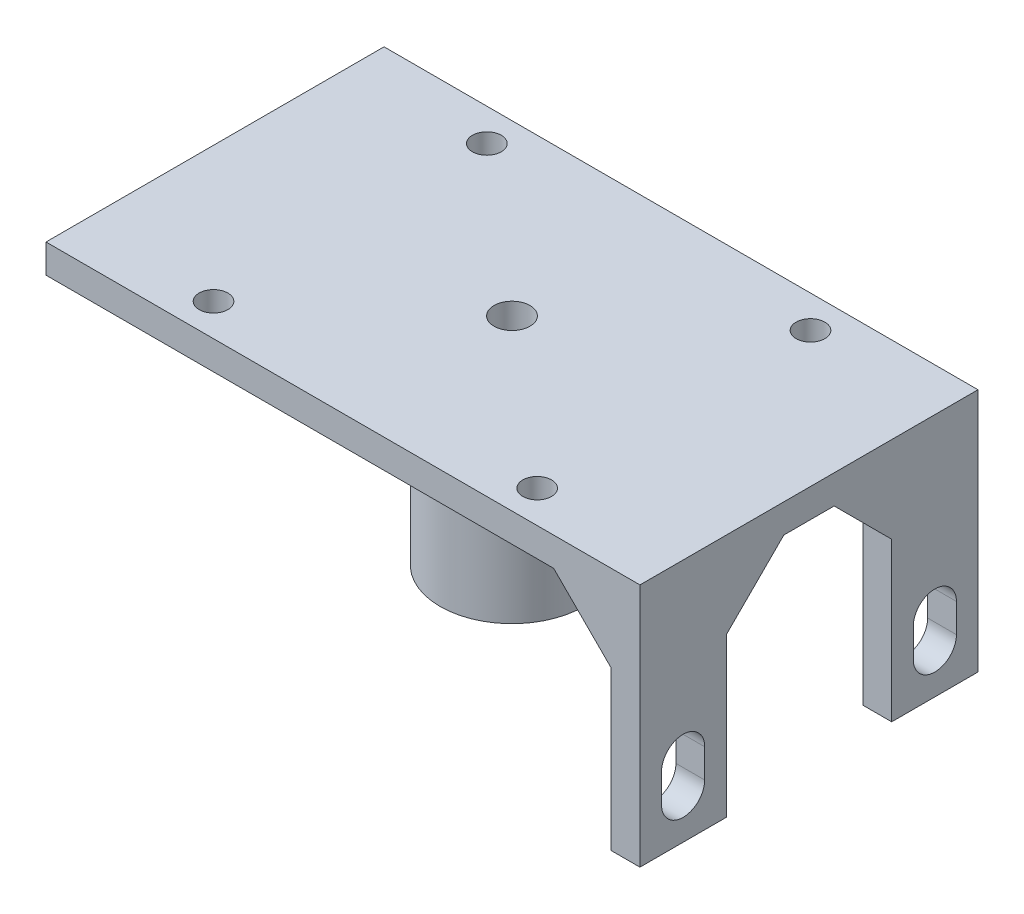
ISO-10303-21;
HEADER;
FILE_DESCRIPTION(('STEP AP214'),'2;1');
FILE_NAME('part.step','',(''),(''),'','','');
FILE_SCHEMA(('AUTOMOTIVE_DESIGN { 1 0 10303 214 1 1 1 1 }'));
ENDSEC;
DATA;
#1=APPLICATION_CONTEXT('core data for automotive mechanical design processes');
#2=APPLICATION_PROTOCOL_DEFINITION('international standard','automotive_design',2000,#1);
#3=PRODUCT_CONTEXT('',#1,'mechanical');
#4=PRODUCT('Part','Part','',(#3));
#5=PRODUCT_RELATED_PRODUCT_CATEGORY('part','',(#4));
#6=PRODUCT_DEFINITION_FORMATION('','',#4);
#7=PRODUCT_DEFINITION_CONTEXT('part definition',#1,'design');
#8=PRODUCT_DEFINITION('design','',#6,#7);
#9=PRODUCT_DEFINITION_SHAPE('','',#8);
#10=(LENGTH_UNIT() NAMED_UNIT(*) SI_UNIT(.MILLI.,.METRE.));
#11=(NAMED_UNIT(*) PLANE_ANGLE_UNIT() SI_UNIT($,.RADIAN.));
#12=(NAMED_UNIT(*) SI_UNIT($,.STERADIAN.) SOLID_ANGLE_UNIT());
#13=UNCERTAINTY_MEASURE_WITH_UNIT(LENGTH_MEASURE(1.E-05),#10,'distance_accuracy_value','');
#14=(GEOMETRIC_REPRESENTATION_CONTEXT(3) GLOBAL_UNCERTAINTY_ASSIGNED_CONTEXT((#13)) GLOBAL_UNIT_ASSIGNED_CONTEXT((#10,
#11,#12)) REPRESENTATION_CONTEXT('',''));
#15=CARTESIAN_POINT('',(0.,0.,0.));
#16=DIRECTION('',(0.,0.,1.));
#17=DIRECTION('',(1.,0.,0.));
#18=AXIS2_PLACEMENT_3D('',#15,#16,#17);
#19=CARTESIAN_POINT('',(0.,-0.0001,0.));
#20=DIRECTION('',(0.,1.,0.));
#21=DIRECTION('',(0.,0.,1.));
#22=AXIS2_PLACEMENT_3D('',#19,#20,#21);
#23=PLANE('',#22);
#24=CARTESIAN_POINT('',(-22.5,-0.000100000000000273,-19.));
#25=DIRECTION('',(0.,1.,0.));
#26=DIRECTION('',(0.,0.,1.));
#27=AXIS2_PLACEMENT_3D('',#24,#25,#26);
#28=CIRCLE('',#27,2.00000000000001);
#29=CARTESIAN_POINT('',(-22.5,-0.000100000000000273,-17.));
#30=VERTEX_POINT('',#29);
#31=EDGE_CURVE('E356',#30,#30,#28,.T.);
#32=ORIENTED_EDGE('',*,*,#31,.T.);
#33=EDGE_LOOP('',(#32));
#34=FACE_BOUND('',#33,.T.);
#35=CARTESIAN_POINT('',(22.5,-0.000100000000000273,-19.));
#36=DIRECTION('',(0.,1.,0.));
#37=DIRECTION('',(0.,0.,1.));
#38=AXIS2_PLACEMENT_3D('',#35,#36,#37);
#39=CIRCLE('',#38,2.);
#40=CARTESIAN_POINT('',(22.5,-0.000100000000000273,-17.));
#41=VERTEX_POINT('',#40);
#42=EDGE_CURVE('E363',#41,#41,#39,.T.);
#43=ORIENTED_EDGE('',*,*,#42,.T.);
#44=EDGE_LOOP('',(#43));
#45=FACE_BOUND('',#44,.T.);
#46=CARTESIAN_POINT('',(22.5,-0.000100000000000273,19.));
#47=DIRECTION('',(0.,1.,0.));
#48=DIRECTION('',(0.,0.,1.));
#49=AXIS2_PLACEMENT_3D('',#46,#47,#48);
#50=CIRCLE('',#49,2.);
#51=CARTESIAN_POINT('',(22.5,-0.000100000000000273,21.));
#52=VERTEX_POINT('',#51);
#53=EDGE_CURVE('E368',#52,#52,#50,.T.);
#54=ORIENTED_EDGE('',*,*,#53,.T.);
#55=EDGE_LOOP('',(#54));
#56=FACE_BOUND('',#55,.T.);
#57=CARTESIAN_POINT('',(-22.5,-0.000100000000000273,19.));
#58=DIRECTION('',(0.,1.,0.));
#59=DIRECTION('',(0.,0.,1.));
#60=AXIS2_PLACEMENT_3D('',#57,#58,#59);
#61=CIRCLE('',#60,2.);
#62=CARTESIAN_POINT('',(-22.5,-0.000100000000000273,21.));
#63=VERTEX_POINT('',#62);
#64=EDGE_CURVE('E526',#63,#63,#61,.T.);
#65=ORIENTED_EDGE('',*,*,#64,.T.);
#66=EDGE_LOOP('',(#65));
#67=FACE_BOUND('',#66,.T.);
#68=CARTESIAN_POINT('',(0.,-0.0001,0.));
#69=DIRECTION('',(0.,1.,0.));
#70=DIRECTION('',(0.,0.,1.));
#71=AXIS2_PLACEMENT_3D('',#68,#69,#70);
#72=CIRCLE('',#71,18.);
#73=CARTESIAN_POINT('',(0.,-0.0001,18.));
#74=VERTEX_POINT('',#73);
#75=EDGE_CURVE('E326',#74,#74,#72,.T.);
#76=ORIENTED_EDGE('',*,*,#75,.T.);
#77=EDGE_LOOP('',(#76));
#78=FACE_BOUND('',#77,.T.);
#79=DIRECTION('',(0.,0.,1.));
#80=VECTOR('',#79,1.);
#81=CARTESIAN_POINT('',(29.2905300612166,-0.0001,0.));
#82=LINE('',#81,#80);
#83=CARTESIAN_POINT('',(29.2905300612166,-0.0001,-23.5));
#84=VERTEX_POINT('',#83);
#85=CARTESIAN_POINT('',(29.2905300612166,-0.0001,-3.49999999999993));
#86=VERTEX_POINT('',#85);
#87=EDGE_CURVE('E329',#84,#86,#82,.T.);
#88=ORIENTED_EDGE('',*,*,#87,.T.);
#89=DIRECTION('',(1.,0.,0.));
#90=VECTOR('',#89,1.);
#91=CARTESIAN_POINT('',(0.,-0.0001,-3.49999999999993));
#92=LINE('',#91,#90);
#93=CARTESIAN_POINT('',(41.2905300612167,-0.0001,-3.49999999999993));
#94=VERTEX_POINT('',#93);
#95=EDGE_CURVE('E331',#86,#94,#92,.T.);
#96=ORIENTED_EDGE('',*,*,#95,.T.);
#97=DIRECTION('',(0.,0.,-1.));
#98=VECTOR('',#97,1.);
#99=CARTESIAN_POINT('',(41.2905300612167,-0.0001,23.5));
#100=LINE('',#99,#98);
#101=CARTESIAN_POINT('',(41.2905300612167,-0.0001,3.50000000000002));
#102=VERTEX_POINT('',#101);
#103=EDGE_CURVE('E255',#102,#94,#100,.T.);
#104=ORIENTED_EDGE('',*,*,#103,.F.);
#105=DIRECTION('',(-1.,0.,0.));
#106=VECTOR('',#105,1.);
#107=CARTESIAN_POINT('',(37.2905300612167,-0.0001,3.50000000000002));
#108=LINE('',#107,#106);
#109=CARTESIAN_POINT('',(29.2905300612167,-0.0001,3.50000000000002));
#110=VERTEX_POINT('',#109);
#111=EDGE_CURVE('E323',#102,#110,#108,.T.);
#112=ORIENTED_EDGE('',*,*,#111,.T.);
#113=DIRECTION('',(0.,0.,1.));
#114=VECTOR('',#113,1.);
#115=CARTESIAN_POINT('',(29.2905300612167,-0.0001,0.));
#116=LINE('',#115,#114);
#117=CARTESIAN_POINT('',(29.2905300612167,-0.0001,23.5));
#118=VERTEX_POINT('',#117);
#119=EDGE_CURVE('E315',#110,#118,#116,.T.);
#120=ORIENTED_EDGE('',*,*,#119,.T.);
#121=DIRECTION('',(1.,0.,0.));
#122=VECTOR('',#121,1.);
#123=CARTESIAN_POINT('',(41.2905300612167,-0.0001,23.5));
#124=LINE('',#123,#122);
#125=CARTESIAN_POINT('',(-41.2905300612167,-0.0001,23.5));
#126=VERTEX_POINT('',#125);
#127=EDGE_CURVE('E263',#126,#118,#124,.T.);
#128=ORIENTED_EDGE('',*,*,#127,.F.);
#129=DIRECTION('',(0.,0.,1.));
#130=VECTOR('',#129,1.);
#131=CARTESIAN_POINT('',(-41.2905300612167,-0.0001,23.5));
#132=LINE('',#131,#130);
#133=CARTESIAN_POINT('',(-41.2905300612167,-0.0001,-23.5));
#134=VERTEX_POINT('',#133);
#135=EDGE_CURVE('E260',#134,#126,#132,.T.);
#136=ORIENTED_EDGE('',*,*,#135,.F.);
#137=DIRECTION('',(-1.,0.,0.));
#138=VECTOR('',#137,1.);
#139=CARTESIAN_POINT('',(41.2905300612167,-0.0001,-23.5));
#140=LINE('',#139,#138);
#141=EDGE_CURVE('E258',#84,#134,#140,.T.);
#142=ORIENTED_EDGE('',*,*,#141,.F.);
#143=EDGE_LOOP('',(#88,#96,#104,#112,#120,#128,#136,#142));
#144=FACE_BOUND('',#143,.T.);
#145=ADVANCED_FACE('F34',(#34,#45,#56,#67,#78,#144),#23,.F.);
#146=CARTESIAN_POINT('',(37.2905300612167,0.,11.5));
#147=DIRECTION('',(0.,0.,1.));
#148=DIRECTION('',(0.,-1.,0.));
#149=AXIS2_PLACEMENT_3D('',#146,#147,#148);
#150=PLANE('',#149);
#151=DIRECTION('',(0.,-1.,0.));
#152=VECTOR('',#151,1.);
#153=CARTESIAN_POINT('',(37.2905300612167,0.,11.5));
#154=LINE('',#153,#152);
#155=CARTESIAN_POINT('',(37.2905300612167,-8.00010000000005,11.5));
#156=VERTEX_POINT('',#155);
#157=CARTESIAN_POINT('',(37.2905300612167,-29.99,11.5));
#158=VERTEX_POINT('',#157);
#159=EDGE_CURVE('E285',#156,#158,#154,.T.);
#160=ORIENTED_EDGE('',*,*,#159,.F.);
#161=DIRECTION('',(1.,0.,0.));
#162=VECTOR('',#161,1.);
#163=CARTESIAN_POINT('',(41.2905300612167,-8.00010000000004,11.5));
#164=LINE('',#163,#162);
#165=CARTESIAN_POINT('',(41.2905300612167,-8.00010000000004,11.5));
#166=VERTEX_POINT('',#165);
#167=EDGE_CURVE('E340',#156,#166,#164,.T.);
#168=ORIENTED_EDGE('',*,*,#167,.T.);
#169=DIRECTION('',(0.,-1.,0.));
#170=VECTOR('',#169,1.);
#171=CARTESIAN_POINT('',(41.2905300612167,0.,11.5));
#172=LINE('',#171,#170);
#173=CARTESIAN_POINT('',(41.2905300612167,-29.99,11.5));
#174=VERTEX_POINT('',#173);
#175=EDGE_CURVE('E304',#166,#174,#172,.T.);
#176=ORIENTED_EDGE('',*,*,#175,.T.);
#177=DIRECTION('',(1.,0.,0.));
#178=VECTOR('',#177,1.);
#179=CARTESIAN_POINT('',(37.2905300612167,-29.99,11.5));
#180=LINE('',#179,#178);
#181=EDGE_CURVE('E311',#158,#174,#180,.T.);
#182=ORIENTED_EDGE('',*,*,#181,.F.);
#183=EDGE_LOOP('',(#160,#168,#176,#182));
#184=FACE_BOUND('',#183,.T.);
#185=ADVANCED_FACE('F412',(#184),#150,.F.);
#186=CARTESIAN_POINT('',(37.2905300612167,0.,0.));
#187=DIRECTION('',(-1.,0.,0.));
#188=DIRECTION('',(0.,0.,1.));
#189=AXIS2_PLACEMENT_3D('',#186,#187,#188);
#190=PLANE('',#189);
#191=CARTESIAN_POINT('',(37.2905300612167,-23.99,17.5));
#192=DIRECTION('',(-1.,0.,0.));
#193=DIRECTION('',(0.,0.,1.));
#194=AXIS2_PLACEMENT_3D('',#191,#192,#193);
#195=CIRCLE('',#194,3.);
#196=CARTESIAN_POINT('',(37.2905300612167,-23.99,14.5));
#197=VERTEX_POINT('',#196);
#198=CARTESIAN_POINT('',(37.2905300612167,-23.99,20.5));
#199=VERTEX_POINT('',#198);
#200=EDGE_CURVE('E271',#197,#199,#195,.T.);
#201=ORIENTED_EDGE('',*,*,#200,.F.);
#202=DIRECTION('',(0.,-1.,0.));
#203=VECTOR('',#202,1.);
#204=CARTESIAN_POINT('',(37.2905300612167,0.,14.5));
#205=LINE('',#204,#203);
#206=CARTESIAN_POINT('',(37.2905300612167,-19.99,14.5));
#207=VERTEX_POINT('',#206);
#208=EDGE_CURVE('E274',#207,#197,#205,.T.);
#209=ORIENTED_EDGE('',*,*,#208,.F.);
#210=CARTESIAN_POINT('',(37.2905300612167,-19.99,17.5));
#211=DIRECTION('',(-1.,0.,0.));
#212=DIRECTION('',(0.,0.,1.));
#213=AXIS2_PLACEMENT_3D('',#210,#211,#212);
#214=CIRCLE('',#213,3.);
#215=CARTESIAN_POINT('',(37.2905300612167,-19.99,20.5));
#216=VERTEX_POINT('',#215);
#217=EDGE_CURVE('E278',#216,#207,#214,.T.);
#218=ORIENTED_EDGE('',*,*,#217,.F.);
#219=DIRECTION('',(0.,-1.,0.));
#220=VECTOR('',#219,1.);
#221=CARTESIAN_POINT('',(37.2905300612167,0.,20.5));
#222=LINE('',#221,#220);
#223=EDGE_CURVE('E281',#216,#199,#222,.T.);
#224=ORIENTED_EDGE('',*,*,#223,.T.);
#225=EDGE_LOOP('',(#201,#209,#218,#224));
#226=FACE_BOUND('',#225,.T.);
#227=DIRECTION('',(0.,-1.,0.));
#228=VECTOR('',#227,1.);
#229=CARTESIAN_POINT('',(37.2905300612167,0.,23.5));
#230=LINE('',#229,#228);
#231=CARTESIAN_POINT('',(37.2905300612167,-8.00010000000005,23.5));
#232=VERTEX_POINT('',#231);
#233=CARTESIAN_POINT('',(37.2905300612167,-29.99,23.5));
#234=VERTEX_POINT('',#233);
#235=EDGE_CURVE('E283',#232,#234,#230,.T.);
#236=ORIENTED_EDGE('',*,*,#235,.F.);
#237=DIRECTION('',(0.,0.,-1.));
#238=VECTOR('',#237,1.);
#239=CARTESIAN_POINT('',(37.2905300612167,-8.00010000000005,0.));
#240=LINE('',#239,#238);
#241=EDGE_CURVE('E56',#232,#156,#240,.T.);
#242=ORIENTED_EDGE('',*,*,#241,.T.);
#243=ORIENTED_EDGE('',*,*,#159,.T.);
#244=DIRECTION('',(0.,0.,1.));
#245=VECTOR('',#244,1.);
#246=CARTESIAN_POINT('',(37.2905300612167,-29.99,0.));
#247=LINE('',#246,#245);
#248=EDGE_CURVE('E287',#158,#234,#247,.T.);
#249=ORIENTED_EDGE('',*,*,#248,.T.);
#250=EDGE_LOOP('',(#236,#242,#243,#249));
#251=FACE_BOUND('',#250,.T.);
#252=ADVANCED_FACE('F417',(#226,#251),#190,.T.);
#253=CARTESIAN_POINT('',(37.2905300612167,0.,23.5));
#254=DIRECTION('',(0.,0.,1.));
#255=DIRECTION('',(0.,-1.,0.));
#256=AXIS2_PLACEMENT_3D('',#253,#254,#255);
#257=PLANE('',#256);
#258=DIRECTION('',(0.,-1.,0.));
#259=VECTOR('',#258,1.);
#260=CARTESIAN_POINT('',(41.2905300612167,0.,23.5));
#261=LINE('',#260,#259);
#262=CARTESIAN_POINT('',(41.2905300612167,4.,23.5));
#263=VERTEX_POINT('',#262);
#264=CARTESIAN_POINT('',(41.2905300612167,-29.99,23.5));
#265=VERTEX_POINT('',#264);
#266=EDGE_CURVE('E302',#263,#265,#261,.T.);
#267=ORIENTED_EDGE('',*,*,#266,.F.);
#268=DIRECTION('',(1.,0.,0.));
#269=VECTOR('',#268,1.);
#270=CARTESIAN_POINT('',(41.2905300612167,4.,23.5));
#271=LINE('',#270,#269);
#272=CARTESIAN_POINT('',(-41.2905300612167,4.,23.5));
#273=VERTEX_POINT('',#272);
#274=EDGE_CURVE('E252',#273,#263,#271,.T.);
#275=ORIENTED_EDGE('',*,*,#274,.F.);
#276=DIRECTION('',(0.,1.,0.));
#277=VECTOR('',#276,1.);
#278=CARTESIAN_POINT('',(-41.2905300612167,-0.0001,23.5));
#279=LINE('',#278,#277);
#280=EDGE_CURVE('E265',#126,#273,#279,.T.);
#281=ORIENTED_EDGE('',*,*,#280,.F.);
#282=ORIENTED_EDGE('',*,*,#127,.T.);
#283=DIRECTION('',(0.707106781186544,-0.707106781186551,0.));
#284=VECTOR('',#283,1.);
#285=CARTESIAN_POINT('',(37.2905300612166,-8.00010000000004,23.5));
#286=LINE('',#285,#284);
#287=EDGE_CURVE('E11',#118,#232,#286,.T.);
#288=ORIENTED_EDGE('',*,*,#287,.T.);
#289=ORIENTED_EDGE('',*,*,#235,.T.);
#290=DIRECTION('',(1.,0.,0.));
#291=VECTOR('',#290,1.);
#292=CARTESIAN_POINT('',(37.2905300612167,-29.99,23.5));
#293=LINE('',#292,#291);
#294=EDGE_CURVE('E308',#234,#265,#293,.T.);
#295=ORIENTED_EDGE('',*,*,#294,.T.);
#296=EDGE_LOOP('',(#267,#275,#281,#282,#288,#289,#295));
#297=FACE_BOUND('',#296,.T.);
#298=ADVANCED_FACE('F401',(#297),#257,.T.);
#299=CARTESIAN_POINT('',(37.2905300612167,-23.99,17.5));
#300=DIRECTION('',(1.,0.,0.));
#301=DIRECTION('',(0.,0.,-1.));
#302=AXIS2_PLACEMENT_3D('',#299,#300,#301);
#303=CYLINDRICAL_SURFACE('',#302,3.);
#304=CARTESIAN_POINT('',(41.2905300612167,-23.99,17.5));
#305=DIRECTION('',(-1.,0.,0.));
#306=DIRECTION('',(0.,0.,1.));
#307=AXIS2_PLACEMENT_3D('',#304,#305,#306);
#308=CIRCLE('',#307,3.);
#309=CARTESIAN_POINT('',(41.2905300612167,-23.99,14.5));
#310=VERTEX_POINT('',#309);
#311=CARTESIAN_POINT('',(41.2905300612167,-23.99,20.5));
#312=VERTEX_POINT('',#311);
#313=EDGE_CURVE('E267',#310,#312,#308,.T.);
#314=ORIENTED_EDGE('',*,*,#313,.F.);
#315=DIRECTION('',(1.,0.,0.));
#316=VECTOR('',#315,1.);
#317=CARTESIAN_POINT('',(37.2905300612167,-23.99,14.5));
#318=LINE('',#317,#316);
#319=EDGE_CURVE('E312',#197,#310,#318,.T.);
#320=ORIENTED_EDGE('',*,*,#319,.F.);
#321=ORIENTED_EDGE('',*,*,#200,.T.);
#322=DIRECTION('',(1.,0.,0.));
#323=VECTOR('',#322,1.);
#324=CARTESIAN_POINT('',(37.2905300612167,-23.99,20.5));
#325=LINE('',#324,#323);
#326=EDGE_CURVE('E290',#199,#312,#325,.T.);
#327=ORIENTED_EDGE('',*,*,#326,.T.);
#328=EDGE_LOOP('',(#314,#320,#321,#327));
#329=FACE_BOUND('',#328,.T.);
#330=ADVANCED_FACE('F440',(#329),#303,.F.);
#331=CARTESIAN_POINT('',(37.2905300612167,0.,14.5));
#332=DIRECTION('',(0.,0.,1.));
#333=DIRECTION('',(0.,-1.,0.));
#334=AXIS2_PLACEMENT_3D('',#331,#332,#333);
#335=PLANE('',#334);
#336=DIRECTION('',(0.,-1.,0.));
#337=VECTOR('',#336,1.);
#338=CARTESIAN_POINT('',(41.2905300612167,0.,14.5));
#339=LINE('',#338,#337);
#340=CARTESIAN_POINT('',(41.2905300612167,-19.99,14.5));
#341=VERTEX_POINT('',#340);
#342=EDGE_CURVE('E293',#341,#310,#339,.T.);
#343=ORIENTED_EDGE('',*,*,#342,.F.);
#344=DIRECTION('',(1.,0.,0.));
#345=VECTOR('',#344,1.);
#346=CARTESIAN_POINT('',(37.2905300612167,-19.99,14.5));
#347=LINE('',#346,#345);
#348=EDGE_CURVE('E319',#207,#341,#347,.T.);
#349=ORIENTED_EDGE('',*,*,#348,.F.);
#350=ORIENTED_EDGE('',*,*,#208,.T.);
#351=ORIENTED_EDGE('',*,*,#319,.T.);
#352=EDGE_LOOP('',(#343,#349,#350,#351));
#353=FACE_BOUND('',#352,.T.);
#354=ADVANCED_FACE('F447',(#353),#335,.T.);
#355=CARTESIAN_POINT('',(37.2905300612167,-19.99,17.5));
#356=DIRECTION('',(1.,0.,0.));
#357=DIRECTION('',(0.,0.,-1.));
#358=AXIS2_PLACEMENT_3D('',#355,#356,#357);
#359=CYLINDRICAL_SURFACE('',#358,3.);
#360=CARTESIAN_POINT('',(41.2905300612167,-19.99,17.5));
#361=DIRECTION('',(-1.,0.,0.));
#362=DIRECTION('',(0.,0.,1.));
#363=AXIS2_PLACEMENT_3D('',#360,#361,#362);
#364=CIRCLE('',#363,3.);
#365=CARTESIAN_POINT('',(41.2905300612167,-19.99,20.5));
#366=VERTEX_POINT('',#365);
#367=EDGE_CURVE('E296',#366,#341,#364,.T.);
#368=ORIENTED_EDGE('',*,*,#367,.F.);
#369=DIRECTION('',(1.,0.,0.));
#370=VECTOR('',#369,1.);
#371=CARTESIAN_POINT('',(37.2905300612167,-19.99,20.5));
#372=LINE('',#371,#370);
#373=EDGE_CURVE('E317',#216,#366,#372,.T.);
#374=ORIENTED_EDGE('',*,*,#373,.F.);
#375=ORIENTED_EDGE('',*,*,#217,.T.);
#376=ORIENTED_EDGE('',*,*,#348,.T.);
#377=EDGE_LOOP('',(#368,#374,#375,#376));
#378=FACE_BOUND('',#377,.T.);
#379=ADVANCED_FACE('F443',(#378),#359,.F.);
#380=CARTESIAN_POINT('',(37.2905300612167,0.,20.5));
#381=DIRECTION('',(0.,0.,1.));
#382=DIRECTION('',(1.,0.,0.));
#383=AXIS2_PLACEMENT_3D('',#380,#381,#382);
#384=PLANE('',#383);
#385=DIRECTION('',(0.,-1.,0.));
#386=VECTOR('',#385,1.);
#387=CARTESIAN_POINT('',(41.2905300612167,0.,20.5));
#388=LINE('',#387,#386);
#389=EDGE_CURVE('E299',#366,#312,#388,.T.);
#390=ORIENTED_EDGE('',*,*,#389,.T.);
#391=ORIENTED_EDGE('',*,*,#326,.F.);
#392=ORIENTED_EDGE('',*,*,#223,.F.);
#393=ORIENTED_EDGE('',*,*,#373,.T.);
#394=EDGE_LOOP('',(#390,#391,#392,#393));
#395=FACE_BOUND('',#394,.T.);
#396=ADVANCED_FACE('F435',(#395),#384,.F.);
#397=CARTESIAN_POINT('',(37.2905300612167,-29.99,0.));
#398=DIRECTION('',(0.,1.,0.));
#399=DIRECTION('',(0.,0.,1.));
#400=AXIS2_PLACEMENT_3D('',#397,#398,#399);
#401=PLANE('',#400);
#402=DIRECTION('',(0.,0.,1.));
#403=VECTOR('',#402,1.);
#404=CARTESIAN_POINT('',(41.2905300612167,-29.99,0.));
#405=LINE('',#404,#403);
#406=EDGE_CURVE('E275',#174,#265,#405,.T.);
#407=ORIENTED_EDGE('',*,*,#406,.T.);
#408=ORIENTED_EDGE('',*,*,#294,.F.);
#409=ORIENTED_EDGE('',*,*,#248,.F.);
#410=ORIENTED_EDGE('',*,*,#181,.T.);
#411=EDGE_LOOP('',(#407,#408,#409,#410));
#412=FACE_BOUND('',#411,.T.);
#413=ADVANCED_FACE('F433',(#412),#401,.F.);
#414=CARTESIAN_POINT('',(41.2905300612167,0.,0.));
#415=DIRECTION('',(-1.,0.,0.));
#416=DIRECTION('',(0.,0.,1.));
#417=AXIS2_PLACEMENT_3D('',#414,#415,#416);
#418=PLANE('',#417);
#419=ORIENTED_EDGE('',*,*,#175,.F.);
#420=DIRECTION('',(0.,-0.707106781186551,0.707106781186544));
#421=VECTOR('',#420,1.);
#422=CARTESIAN_POINT('',(41.2905300612167,1.74995000000001,1.74995000000003));
#423=LINE('',#422,#421);
#424=EDGE_CURVE('E43',#166,#102,#423,.F.);
#425=ORIENTED_EDGE('',*,*,#424,.T.);
#426=ORIENTED_EDGE('',*,*,#103,.T.);
#427=DIRECTION('',(0.,-0.707106781186544,-0.707106781186551));
#428=VECTOR('',#427,1.);
#429=CARTESIAN_POINT('',(41.2905300612167,1.74994999999997,-1.74994999999995));
#430=LINE('',#429,#428);
#431=CARTESIAN_POINT('',(41.2905300612167,-8.00009999999996,-11.5));
#432=VERTEX_POINT('',#431);
#433=EDGE_CURVE('E343',#94,#432,#430,.T.);
#434=ORIENTED_EDGE('',*,*,#433,.T.);
#435=DIRECTION('',(0.,-1.,0.));
#436=VECTOR('',#435,1.);
#437=CARTESIAN_POINT('',(41.2905300612167,0.,-11.5));
#438=LINE('',#437,#436);
#439=CARTESIAN_POINT('',(41.2905300612167,-29.99,-11.5));
#440=VERTEX_POINT('',#439);
#441=EDGE_CURVE('E217',#432,#440,#438,.T.);
#442=ORIENTED_EDGE('',*,*,#441,.T.);
#443=DIRECTION('',(0.,0.,-1.));
#444=VECTOR('',#443,1.);
#445=CARTESIAN_POINT('',(41.2905300612167,-29.99,0.));
#446=LINE('',#445,#444);
#447=CARTESIAN_POINT('',(41.2905300612167,-29.99,-23.5));
#448=VERTEX_POINT('',#447);
#449=EDGE_CURVE('E219',#440,#448,#446,.T.);
#450=ORIENTED_EDGE('',*,*,#449,.T.);
#451=DIRECTION('',(0.,1.,0.));
#452=VECTOR('',#451,1.);
#453=CARTESIAN_POINT('',(41.2905300612167,-0.0001,-23.5));
#454=LINE('',#453,#452);
#455=CARTESIAN_POINT('',(41.2905300612167,4.,-23.5));
#456=VERTEX_POINT('',#455);
#457=EDGE_CURVE('E194',#448,#456,#454,.T.);
#458=ORIENTED_EDGE('',*,*,#457,.T.);
#459=DIRECTION('',(0.,0.,-1.));
#460=VECTOR('',#459,1.);
#461=CARTESIAN_POINT('',(41.2905300612167,4.,23.5));
#462=LINE('',#461,#460);
#463=EDGE_CURVE('E242',#263,#456,#462,.T.);
#464=ORIENTED_EDGE('',*,*,#463,.F.);
#465=ORIENTED_EDGE('',*,*,#266,.T.);
#466=ORIENTED_EDGE('',*,*,#406,.F.);
#467=EDGE_LOOP('',(#419,#425,#426,#434,#442,#450,#458,#464,#465,#466));
#468=FACE_BOUND('',#467,.T.);
#469=ORIENTED_EDGE('',*,*,#313,.T.);
#470=ORIENTED_EDGE('',*,*,#389,.F.);
#471=ORIENTED_EDGE('',*,*,#367,.T.);
#472=ORIENTED_EDGE('',*,*,#342,.T.);
#473=EDGE_LOOP('',(#469,#470,#471,#472));
#474=FACE_BOUND('',#473,.T.);
#475=DIRECTION('',(0.,-1.,0.));
#476=VECTOR('',#475,1.);
#477=CARTESIAN_POINT('',(41.2905300612167,0.,-14.5));
#478=LINE('',#477,#476);
#479=CARTESIAN_POINT('',(41.2905300612167,-19.99,-14.5));
#480=VERTEX_POINT('',#479);
#481=CARTESIAN_POINT('',(41.2905300612167,-23.99,-14.5));
#482=VERTEX_POINT('',#481);
#483=EDGE_CURVE('E222',#480,#482,#478,.T.);
#484=ORIENTED_EDGE('',*,*,#483,.F.);
#485=CARTESIAN_POINT('',(41.2905300612167,-19.99,-17.5));
#486=DIRECTION('',(-1.,0.,0.));
#487=DIRECTION('',(0.,0.,1.));
#488=AXIS2_PLACEMENT_3D('',#485,#486,#487);
#489=CIRCLE('',#488,3.);
#490=CARTESIAN_POINT('',(41.2905300612167,-19.99,-20.5));
#491=VERTEX_POINT('',#490);
#492=EDGE_CURVE('E231',#491,#480,#489,.F.);
#493=ORIENTED_EDGE('',*,*,#492,.F.);
#494=DIRECTION('',(0.,-1.,0.));
#495=VECTOR('',#494,1.);
#496=CARTESIAN_POINT('',(41.2905300612167,0.,-20.5));
#497=LINE('',#496,#495);
#498=CARTESIAN_POINT('',(41.2905300612167,-23.99,-20.5));
#499=VERTEX_POINT('',#498);
#500=EDGE_CURVE('E228',#491,#499,#497,.T.);
#501=ORIENTED_EDGE('',*,*,#500,.T.);
#502=CARTESIAN_POINT('',(41.2905300612167,-23.99,-17.5));
#503=DIRECTION('',(-1.,0.,0.));
#504=DIRECTION('',(0.,0.,1.));
#505=AXIS2_PLACEMENT_3D('',#502,#503,#504);
#506=CIRCLE('',#505,3.);
#507=EDGE_CURVE('E225',#482,#499,#506,.F.);
#508=ORIENTED_EDGE('',*,*,#507,.F.);
#509=EDGE_LOOP('',(#484,#493,#501,#508));
#510=FACE_BOUND('',#509,.T.);
#511=ADVANCED_FACE('F393',(#468,#474,#510),#418,.F.);
#512=CARTESIAN_POINT('',(-41.2905300612167,-0.0001,23.5));
#513=DIRECTION('',(-1.,0.,0.));
#514=DIRECTION('',(0.,0.,1.));
#515=AXIS2_PLACEMENT_3D('',#512,#513,#514);
#516=PLANE('',#515);
#517=ORIENTED_EDGE('',*,*,#280,.T.);
#518=DIRECTION('',(0.,0.,1.));
#519=VECTOR('',#518,1.);
#520=CARTESIAN_POINT('',(-41.2905300612167,4.,23.5));
#521=LINE('',#520,#519);
#522=CARTESIAN_POINT('',(-41.2905300612167,4.,-23.5));
#523=VERTEX_POINT('',#522);
#524=EDGE_CURVE('E249',#523,#273,#521,.T.);
#525=ORIENTED_EDGE('',*,*,#524,.F.);
#526=DIRECTION('',(0.,1.,0.));
#527=VECTOR('',#526,1.);
#528=CARTESIAN_POINT('',(-41.2905300612167,-0.0001,-23.5));
#529=LINE('',#528,#527);
#530=EDGE_CURVE('E268',#134,#523,#529,.T.);
#531=ORIENTED_EDGE('',*,*,#530,.F.);
#532=ORIENTED_EDGE('',*,*,#135,.T.);
#533=EDGE_LOOP('',(#517,#525,#531,#532));
#534=FACE_BOUND('',#533,.T.);
#535=ADVANCED_FACE('F385',(#534),#516,.T.);
#536=CARTESIAN_POINT('',(41.2905300612167,-0.0001,-23.5));
#537=DIRECTION('',(0.,0.,-1.));
#538=DIRECTION('',(-1.,0.,0.));
#539=AXIS2_PLACEMENT_3D('',#536,#537,#538);
#540=PLANE('',#539);
#541=DIRECTION('',(-1.,0.,0.));
#542=VECTOR('',#541,1.);
#543=CARTESIAN_POINT('',(41.2905300612167,4.,-23.5));
#544=LINE('',#543,#542);
#545=EDGE_CURVE('E246',#456,#523,#544,.T.);
#546=ORIENTED_EDGE('',*,*,#545,.F.);
#547=ORIENTED_EDGE('',*,*,#457,.F.);
#548=DIRECTION('',(1.,0.,0.));
#549=VECTOR('',#548,1.);
#550=CARTESIAN_POINT('',(37.2905300612167,-29.99,-23.5));
#551=LINE('',#550,#549);
#552=CARTESIAN_POINT('',(37.2905300612167,-29.99,-23.5));
#553=VERTEX_POINT('',#552);
#554=EDGE_CURVE('E191',#553,#448,#551,.T.);
#555=ORIENTED_EDGE('',*,*,#554,.F.);
#556=DIRECTION('',(0.,-1.,0.));
#557=VECTOR('',#556,1.);
#558=CARTESIAN_POINT('',(37.2905300612167,0.,-23.5));
#559=LINE('',#558,#557);
#560=CARTESIAN_POINT('',(37.2905300612167,-8.00009999999996,-23.5));
#561=VERTEX_POINT('',#560);
#562=EDGE_CURVE('E178',#561,#553,#559,.T.);
#563=ORIENTED_EDGE('',*,*,#562,.F.);
#564=DIRECTION('',(-0.707106781186551,0.707106781186544,0.));
#565=VECTOR('',#564,1.);
#566=CARTESIAN_POINT('',(29.2905300612166,-0.0001,-23.5));
#567=LINE('',#566,#565);
#568=EDGE_CURVE('E345',#561,#84,#567,.T.);
#569=ORIENTED_EDGE('',*,*,#568,.T.);
#570=ORIENTED_EDGE('',*,*,#141,.T.);
#571=ORIENTED_EDGE('',*,*,#530,.T.);
#572=EDGE_LOOP('',(#546,#547,#555,#563,#569,#570,#571));
#573=FACE_BOUND('',#572,.T.);
#574=ADVANCED_FACE('F193',(#573),#540,.T.);
#575=CARTESIAN_POINT('',(0.,4.,0.));
#576=DIRECTION('',(0.,1.,0.));
#577=DIRECTION('',(0.,0.,1.));
#578=AXIS2_PLACEMENT_3D('',#575,#576,#577);
#579=PLANE('',#578);
#580=CARTESIAN_POINT('',(0.,4.,0.));
#581=DIRECTION('',(0.,-1.,0.));
#582=DIRECTION('',(0.,0.,-1.));
#583=AXIS2_PLACEMENT_3D('',#580,#581,#582);
#584=CIRCLE('',#583,2.5);
#585=CARTESIAN_POINT('',(0.,4.,-2.5));
#586=VERTEX_POINT('',#585);
#587=EDGE_CURVE('E509',#586,#586,#584,.T.);
#588=ORIENTED_EDGE('',*,*,#587,.T.);
#589=EDGE_LOOP('',(#588));
#590=FACE_BOUND('',#589,.T.);
#591=CARTESIAN_POINT('',(-22.5,4.,-19.));
#592=DIRECTION('',(0.,-1.,0.));
#593=DIRECTION('',(0.,0.,-1.));
#594=AXIS2_PLACEMENT_3D('',#591,#592,#593);
#595=CIRCLE('',#594,2.00000000000001);
#596=CARTESIAN_POINT('',(-22.5,4.,-21.));
#597=VERTEX_POINT('',#596);
#598=EDGE_CURVE('E513',#597,#597,#595,.T.);
#599=ORIENTED_EDGE('',*,*,#598,.T.);
#600=EDGE_LOOP('',(#599));
#601=FACE_BOUND('',#600,.T.);
#602=CARTESIAN_POINT('',(22.5,4.,-19.));
#603=DIRECTION('',(0.,-1.,0.));
#604=DIRECTION('',(0.,0.,-1.));
#605=AXIS2_PLACEMENT_3D('',#602,#603,#604);
#606=CIRCLE('',#605,2.);
#607=CARTESIAN_POINT('',(22.5,4.,-21.));
#608=VERTEX_POINT('',#607);
#609=EDGE_CURVE('E517',#608,#608,#606,.T.);
#610=ORIENTED_EDGE('',*,*,#609,.T.);
#611=EDGE_LOOP('',(#610));
#612=FACE_BOUND('',#611,.T.);
#613=CARTESIAN_POINT('',(22.5,4.,19.));
#614=DIRECTION('',(0.,-1.,0.));
#615=DIRECTION('',(0.,0.,-1.));
#616=AXIS2_PLACEMENT_3D('',#613,#614,#615);
#617=CIRCLE('',#616,2.);
#618=CARTESIAN_POINT('',(22.5,4.,17.));
#619=VERTEX_POINT('',#618);
#620=EDGE_CURVE('E521',#619,#619,#617,.T.);
#621=ORIENTED_EDGE('',*,*,#620,.T.);
#622=EDGE_LOOP('',(#621));
#623=FACE_BOUND('',#622,.T.);
#624=CARTESIAN_POINT('',(-22.5,4.,19.));
#625=DIRECTION('',(0.,-1.,0.));
#626=DIRECTION('',(0.,0.,-1.));
#627=AXIS2_PLACEMENT_3D('',#624,#625,#626);
#628=CIRCLE('',#627,2.);
#629=CARTESIAN_POINT('',(-22.5,4.,17.));
#630=VERTEX_POINT('',#629);
#631=EDGE_CURVE('E524',#630,#630,#628,.T.);
#632=ORIENTED_EDGE('',*,*,#631,.T.);
#633=EDGE_LOOP('',(#632));
#634=FACE_BOUND('',#633,.T.);
#635=ORIENTED_EDGE('',*,*,#463,.T.);
#636=ORIENTED_EDGE('',*,*,#545,.T.);
#637=ORIENTED_EDGE('',*,*,#524,.T.);
#638=ORIENTED_EDGE('',*,*,#274,.T.);
#639=EDGE_LOOP('',(#635,#636,#637,#638));
#640=FACE_BOUND('',#639,.T.);
#641=ADVANCED_FACE('F388',(#590,#601,#612,#623,#634,#640),#579,.T.);
#642=CARTESIAN_POINT('',(37.2905300612167,0.,-11.5));
#643=DIRECTION('',(0.,0.,1.));
#644=DIRECTION('',(0.,-1.,0.));
#645=AXIS2_PLACEMENT_3D('',#642,#643,#644);
#646=PLANE('',#645);
#647=ORIENTED_EDGE('',*,*,#441,.F.);
#648=DIRECTION('',(-1.,0.,0.));
#649=VECTOR('',#648,1.);
#650=CARTESIAN_POINT('',(37.2905300612167,-8.00009999999996,-11.5));
#651=LINE('',#650,#649);
#652=CARTESIAN_POINT('',(37.2905300612167,-8.00009999999996,-11.5));
#653=VERTEX_POINT('',#652);
#654=EDGE_CURVE('E334',#432,#653,#651,.T.);
#655=ORIENTED_EDGE('',*,*,#654,.T.);
#656=DIRECTION('',(0.,-1.,0.));
#657=VECTOR('',#656,1.);
#658=CARTESIAN_POINT('',(37.2905300612167,0.,-11.5));
#659=LINE('',#658,#657);
#660=CARTESIAN_POINT('',(37.2905300612167,-29.99,-11.5));
#661=VERTEX_POINT('',#660);
#662=EDGE_CURVE('E188',#653,#661,#659,.T.);
#663=ORIENTED_EDGE('',*,*,#662,.T.);
#664=DIRECTION('',(1.,0.,0.));
#665=VECTOR('',#664,1.);
#666=CARTESIAN_POINT('',(37.2905300612167,-29.99,-11.5));
#667=LINE('',#666,#665);
#668=EDGE_CURVE('E199',#661,#440,#667,.T.);
#669=ORIENTED_EDGE('',*,*,#668,.T.);
#670=EDGE_LOOP('',(#647,#655,#663,#669));
#671=FACE_BOUND('',#670,.T.);
#672=ADVANCED_FACE('F375',(#671),#646,.T.);
#673=CARTESIAN_POINT('',(37.2905300612167,0.,0.));
#674=DIRECTION('',(-1.,0.,0.));
#675=DIRECTION('',(0.,0.,1.));
#676=AXIS2_PLACEMENT_3D('',#673,#674,#675);
#677=PLANE('',#676);
#678=DIRECTION('',(0.,-1.,0.));
#679=VECTOR('',#678,1.);
#680=CARTESIAN_POINT('',(37.2905300612167,0.,-14.5));
#681=LINE('',#680,#679);
#682=CARTESIAN_POINT('',(37.2905300612167,-19.99,-14.5));
#683=VERTEX_POINT('',#682);
#684=CARTESIAN_POINT('',(37.2905300612167,-23.99,-14.5));
#685=VERTEX_POINT('',#684);
#686=EDGE_CURVE('E204',#683,#685,#681,.T.);
#687=ORIENTED_EDGE('',*,*,#686,.T.);
#688=CARTESIAN_POINT('',(37.2905300612167,-23.99,-17.5));
#689=DIRECTION('',(-1.,0.,0.));
#690=DIRECTION('',(0.,0.,1.));
#691=AXIS2_PLACEMENT_3D('',#688,#689,#690);
#692=CIRCLE('',#691,3.);
#693=CARTESIAN_POINT('',(37.2905300612167,-23.99,-20.5));
#694=VERTEX_POINT('',#693);
#695=EDGE_CURVE('E207',#685,#694,#692,.F.);
#696=ORIENTED_EDGE('',*,*,#695,.T.);
#697=DIRECTION('',(0.,-1.,0.));
#698=VECTOR('',#697,1.);
#699=CARTESIAN_POINT('',(37.2905300612167,0.,-20.5));
#700=LINE('',#699,#698);
#701=CARTESIAN_POINT('',(37.2905300612167,-19.99,-20.5));
#702=VERTEX_POINT('',#701);
#703=EDGE_CURVE('E212',#702,#694,#700,.T.);
#704=ORIENTED_EDGE('',*,*,#703,.F.);
#705=CARTESIAN_POINT('',(37.2905300612167,-19.99,-17.5));
#706=DIRECTION('',(-1.,0.,0.));
#707=DIRECTION('',(0.,0.,1.));
#708=AXIS2_PLACEMENT_3D('',#705,#706,#707);
#709=CIRCLE('',#708,3.);
#710=EDGE_CURVE('E215',#702,#683,#709,.F.);
#711=ORIENTED_EDGE('',*,*,#710,.T.);
#712=EDGE_LOOP('',(#687,#696,#704,#711));
#713=FACE_BOUND('',#712,.T.);
#714=ORIENTED_EDGE('',*,*,#662,.F.);
#715=DIRECTION('',(0.,0.,-1.));
#716=VECTOR('',#715,1.);
#717=CARTESIAN_POINT('',(37.2905300612167,-8.00009999999996,0.));
#718=LINE('',#717,#716);
#719=EDGE_CURVE('E185',#653,#561,#718,.T.);
#720=ORIENTED_EDGE('',*,*,#719,.T.);
#721=ORIENTED_EDGE('',*,*,#562,.T.);
#722=DIRECTION('',(0.,0.,-1.));
#723=VECTOR('',#722,1.);
#724=CARTESIAN_POINT('',(37.2905300612167,-29.99,0.));
#725=LINE('',#724,#723);
#726=EDGE_CURVE('E183',#661,#553,#725,.T.);
#727=ORIENTED_EDGE('',*,*,#726,.F.);
#728=EDGE_LOOP('',(#714,#720,#721,#727));
#729=FACE_BOUND('',#728,.T.);
#730=ADVANCED_FACE('F181',(#713,#729),#677,.T.);
#731=CARTESIAN_POINT('',(37.2905300612167,0.,-14.5));
#732=DIRECTION('',(0.,0.,1.));
#733=DIRECTION('',(0.,-1.,0.));
#734=AXIS2_PLACEMENT_3D('',#731,#732,#733);
#735=PLANE('',#734);
#736=ORIENTED_EDGE('',*,*,#483,.T.);
#737=DIRECTION('',(1.,0.,0.));
#738=VECTOR('',#737,1.);
#739=CARTESIAN_POINT('',(37.2905300612167,-23.99,-14.5));
#740=LINE('',#739,#738);
#741=EDGE_CURVE('E239',#685,#482,#740,.T.);
#742=ORIENTED_EDGE('',*,*,#741,.F.);
#743=ORIENTED_EDGE('',*,*,#686,.F.);
#744=DIRECTION('',(1.,0.,0.));
#745=VECTOR('',#744,1.);
#746=CARTESIAN_POINT('',(37.2905300612167,-19.99,-14.5));
#747=LINE('',#746,#745);
#748=EDGE_CURVE('E198',#683,#480,#747,.T.);
#749=ORIENTED_EDGE('',*,*,#748,.T.);
#750=EDGE_LOOP('',(#736,#742,#743,#749));
#751=FACE_BOUND('',#750,.T.);
#752=ADVANCED_FACE('F482',(#751),#735,.F.);
#753=CARTESIAN_POINT('',(37.2905300612167,-23.99,-17.5));
#754=DIRECTION('',(1.,0.,0.));
#755=DIRECTION('',(0.,0.,-1.));
#756=AXIS2_PLACEMENT_3D('',#753,#754,#755);
#757=CYLINDRICAL_SURFACE('',#756,3.);
#758=ORIENTED_EDGE('',*,*,#507,.T.);
#759=DIRECTION('',(1.,0.,0.));
#760=VECTOR('',#759,1.);
#761=CARTESIAN_POINT('',(37.2905300612167,-23.99,-20.5));
#762=LINE('',#761,#760);
#763=EDGE_CURVE('E237',#694,#499,#762,.T.);
#764=ORIENTED_EDGE('',*,*,#763,.F.);
#765=ORIENTED_EDGE('',*,*,#695,.F.);
#766=ORIENTED_EDGE('',*,*,#741,.T.);
#767=EDGE_LOOP('',(#758,#764,#765,#766));
#768=FACE_BOUND('',#767,.T.);
#769=ADVANCED_FACE('F490',(#768),#757,.F.);
#770=CARTESIAN_POINT('',(37.2905300612167,0.,-20.5));
#771=DIRECTION('',(0.,0.,1.));
#772=DIRECTION('',(1.,0.,0.));
#773=AXIS2_PLACEMENT_3D('',#770,#771,#772);
#774=PLANE('',#773);
#775=ORIENTED_EDGE('',*,*,#500,.F.);
#776=DIRECTION('',(1.,0.,0.));
#777=VECTOR('',#776,1.);
#778=CARTESIAN_POINT('',(37.2905300612167,-19.99,-20.5));
#779=LINE('',#778,#777);
#780=EDGE_CURVE('E235',#702,#491,#779,.T.);
#781=ORIENTED_EDGE('',*,*,#780,.F.);
#782=ORIENTED_EDGE('',*,*,#703,.T.);
#783=ORIENTED_EDGE('',*,*,#763,.T.);
#784=EDGE_LOOP('',(#775,#781,#782,#783));
#785=FACE_BOUND('',#784,.T.);
#786=ADVANCED_FACE('F487',(#785),#774,.T.);
#787=CARTESIAN_POINT('',(37.2905300612167,-29.99,0.));
#788=DIRECTION('',(0.,-1.,0.));
#789=DIRECTION('',(0.,0.,-1.));
#790=AXIS2_PLACEMENT_3D('',#787,#788,#789);
#791=PLANE('',#790);
#792=ORIENTED_EDGE('',*,*,#449,.F.);
#793=ORIENTED_EDGE('',*,*,#668,.F.);
#794=ORIENTED_EDGE('',*,*,#726,.T.);
#795=ORIENTED_EDGE('',*,*,#554,.T.);
#796=EDGE_LOOP('',(#792,#793,#794,#795));
#797=FACE_BOUND('',#796,.T.);
#798=ADVANCED_FACE('F202',(#797),#791,.T.);
#799=CARTESIAN_POINT('',(37.2905300612167,-19.99,-17.5));
#800=DIRECTION('',(1.,0.,0.));
#801=DIRECTION('',(0.,0.,-1.));
#802=AXIS2_PLACEMENT_3D('',#799,#800,#801);
#803=CYLINDRICAL_SURFACE('',#802,3.);
#804=ORIENTED_EDGE('',*,*,#492,.T.);
#805=ORIENTED_EDGE('',*,*,#748,.F.);
#806=ORIENTED_EDGE('',*,*,#710,.F.);
#807=ORIENTED_EDGE('',*,*,#780,.T.);
#808=EDGE_LOOP('',(#804,#805,#806,#807));
#809=FACE_BOUND('',#808,.T.);
#810=ADVANCED_FACE('F478',(#809),#803,.F.);
#811=CARTESIAN_POINT('',(0.,0.,0.));
#812=DIRECTION('',(0.,1.,0.));
#813=DIRECTION('',(0.,0.,1.));
#814=AXIS2_PLACEMENT_3D('',#811,#812,#813);
#815=CYLINDRICAL_SURFACE('',#814,9.99999999999999);
#816=CARTESIAN_POINT('',(0.,-8.00010000000014,0.));
#817=DIRECTION('',(0.,1.,0.));
#818=DIRECTION('',(0.,0.,1.));
#819=AXIS2_PLACEMENT_3D('',#816,#817,#818);
#820=CIRCLE('',#819,9.99999999999999);
#821=CARTESIAN_POINT('',(0.,-8.00010000000014,9.99999999999999));
#822=VERTEX_POINT('',#821);
#823=EDGE_CURVE('E337',#822,#822,#820,.F.);
#824=ORIENTED_EDGE('',*,*,#823,.T.);
#825=EDGE_LOOP('',(#824));
#826=FACE_BOUND('',#825,.T.);
#827=CARTESIAN_POINT('',(0.,-26.,0.));
#828=DIRECTION('',(0.,1.,0.));
#829=DIRECTION('',(0.,0.,1.));
#830=AXIS2_PLACEMENT_3D('',#827,#828,#829);
#831=CIRCLE('',#830,10.);
#832=CARTESIAN_POINT('',(0.,-26.,10.));
#833=VERTEX_POINT('',#832);
#834=EDGE_CURVE('E220',#833,#833,#831,.T.);
#835=ORIENTED_EDGE('',*,*,#834,.T.);
#836=EDGE_LOOP('',(#835));
#837=FACE_BOUND('',#836,.T.);
#838=ADVANCED_FACE('F468',(#826,#837),#815,.T.);
#839=CARTESIAN_POINT('',(-10.,-26.,0.));
#840=DIRECTION('',(0.,-1.,0.));
#841=DIRECTION('',(0.,0.,-1.));
#842=AXIS2_PLACEMENT_3D('',#839,#840,#841);
#843=PLANE('',#842);
#844=CARTESIAN_POINT('',(0.,-26.,0.));
#845=DIRECTION('',(0.,1.,0.));
#846=DIRECTION('',(0.,0.,1.));
#847=AXIS2_PLACEMENT_3D('',#844,#845,#846);
#848=CIRCLE('',#847,2.5);
#849=CARTESIAN_POINT('',(0.,-26.,2.5));
#850=VERTEX_POINT('',#849);
#851=EDGE_CURVE('E349',#850,#850,#848,.T.);
#852=ORIENTED_EDGE('',*,*,#851,.T.);
#853=EDGE_LOOP('',(#852));
#854=FACE_BOUND('',#853,.T.);
#855=ORIENTED_EDGE('',*,*,#834,.F.);
#856=EDGE_LOOP('',(#855));
#857=FACE_BOUND('',#856,.T.);
#858=ADVANCED_FACE('F462',(#854,#857),#843,.T.);
#859=CARTESIAN_POINT('',(0.,0.,0.));
#860=DIRECTION('',(0.,1.,0.));
#861=DIRECTION('',(0.,0.,1.));
#862=AXIS2_PLACEMENT_3D('',#859,#860,#861);
#863=CYLINDRICAL_SURFACE('',#862,2.5);
#864=ORIENTED_EDGE('',*,*,#851,.F.);
#865=EDGE_LOOP('',(#864));
#866=FACE_BOUND('',#865,.T.);
#867=ORIENTED_EDGE('',*,*,#587,.F.);
#868=EDGE_LOOP('',(#867));
#869=FACE_BOUND('',#868,.T.);
#870=ADVANCED_FACE('F458',(#866,#869),#863,.F.);
#871=CARTESIAN_POINT('',(29.2905300612166,-0.0001,0.));
#872=DIRECTION('',(0.707106781186544,0.707106781186551,0.));
#873=DIRECTION('',(0.,0.,1.));
#874=AXIS2_PLACEMENT_3D('',#871,#872,#873);
#875=PLANE('',#874);
#876=ORIENTED_EDGE('',*,*,#568,.F.);
#877=ORIENTED_EDGE('',*,*,#719,.F.);
#878=DIRECTION('',(-0.577350269189628,0.577350269189622,0.577350269189628));
#879=VECTOR('',#878,1.);
#880=CARTESIAN_POINT('',(28.12386339455,1.16656666666664,-2.33333333333328));
#881=LINE('',#880,#879);
#882=EDGE_CURVE('E347',#86,#653,#881,.F.);
#883=ORIENTED_EDGE('',*,*,#882,.F.);
#884=ORIENTED_EDGE('',*,*,#87,.F.);
#885=EDGE_LOOP('',(#876,#877,#883,#884));
#886=FACE_BOUND('',#885,.T.);
#887=ADVANCED_FACE('F377',(#886),#875,.F.);
#888=CARTESIAN_POINT('',(0.,-0.0001,-3.49999999999993));
#889=DIRECTION('',(0.,0.707106781186551,-0.707106781186544));
#890=DIRECTION('',(1.,0.,0.));
#891=AXIS2_PLACEMENT_3D('',#888,#889,#890);
#892=PLANE('',#891);
#893=ORIENTED_EDGE('',*,*,#882,.T.);
#894=ORIENTED_EDGE('',*,*,#654,.F.);
#895=ORIENTED_EDGE('',*,*,#433,.F.);
#896=ORIENTED_EDGE('',*,*,#95,.F.);
#897=EDGE_LOOP('',(#893,#894,#895,#896));
#898=FACE_BOUND('',#897,.T.);
#899=ADVANCED_FACE('F396',(#898),#892,.F.);
#900=CARTESIAN_POINT('',(0.,-0.0001,0.));
#901=DIRECTION('',(0.,1.,0.));
#902=DIRECTION('',(0.,0.,1.));
#903=AXIS2_PLACEMENT_3D('',#900,#901,#902);
#904=CONICAL_SURFACE('',#903,18.,0.785398163397443);
#905=ORIENTED_EDGE('',*,*,#823,.F.);
#906=EDGE_LOOP('',(#905));
#907=FACE_BOUND('',#906,.T.);
#908=ORIENTED_EDGE('',*,*,#75,.F.);
#909=EDGE_LOOP('',(#908));
#910=FACE_BOUND('',#909,.T.);
#911=ADVANCED_FACE('F403',(#907,#910),#904,.T.);
#912=CARTESIAN_POINT('',(37.2905300612167,-8.00010000000005,0.));
#913=DIRECTION('',(0.707106781186551,0.707106781186544,0.));
#914=DIRECTION('',(0.,0.,-1.));
#915=AXIS2_PLACEMENT_3D('',#912,#913,#914);
#916=PLANE('',#915);
#917=ORIENTED_EDGE('',*,*,#287,.F.);
#918=ORIENTED_EDGE('',*,*,#119,.F.);
#919=DIRECTION('',(-0.577350269189624,0.57735026918963,-0.577350269189624));
#920=VECTOR('',#919,1.);
#921=CARTESIAN_POINT('',(33.4571967278833,-4.1667666666667,7.66666666666668));
#922=LINE('',#921,#920);
#923=EDGE_CURVE('E38',#156,#110,#922,.T.);
#924=ORIENTED_EDGE('',*,*,#923,.F.);
#925=ORIENTED_EDGE('',*,*,#241,.F.);
#926=EDGE_LOOP('',(#917,#918,#924,#925));
#927=FACE_BOUND('',#926,.T.);
#928=ADVANCED_FACE('F36',(#927),#916,.F.);
#929=CARTESIAN_POINT('',(0.,-0.0001,3.50000000000002));
#930=DIRECTION('',(0.,-0.707106781186544,-0.707106781186551));
#931=DIRECTION('',(1.,0.,0.));
#932=AXIS2_PLACEMENT_3D('',#929,#930,#931);
#933=PLANE('',#932);
#934=ORIENTED_EDGE('',*,*,#424,.F.);
#935=ORIENTED_EDGE('',*,*,#167,.F.);
#936=ORIENTED_EDGE('',*,*,#923,.T.);
#937=ORIENTED_EDGE('',*,*,#111,.F.);
#938=EDGE_LOOP('',(#934,#935,#936,#937));
#939=FACE_BOUND('',#938,.T.);
#940=ADVANCED_FACE('F399',(#939),#933,.T.);
#941=CARTESIAN_POINT('',(-22.5,4.,19.));
#942=DIRECTION('',(0.,-1.,0.));
#943=DIRECTION('',(0.,0.,-1.));
#944=AXIS2_PLACEMENT_3D('',#941,#942,#943);
#945=CYLINDRICAL_SURFACE('',#944,2.);
#946=ORIENTED_EDGE('',*,*,#631,.F.);
#947=EDGE_LOOP('',(#946));
#948=FACE_BOUND('',#947,.T.);
#949=ORIENTED_EDGE('',*,*,#64,.F.);
#950=EDGE_LOOP('',(#949));
#951=FACE_BOUND('',#950,.T.);
#952=ADVANCED_FACE('F408',(#948,#951),#945,.F.);
#953=CARTESIAN_POINT('',(22.5,4.,19.));
#954=DIRECTION('',(0.,-1.,0.));
#955=DIRECTION('',(0.,0.,-1.));
#956=AXIS2_PLACEMENT_3D('',#953,#954,#955);
#957=CYLINDRICAL_SURFACE('',#956,2.);
#958=ORIENTED_EDGE('',*,*,#620,.F.);
#959=EDGE_LOOP('',(#958));
#960=FACE_BOUND('',#959,.T.);
#961=ORIENTED_EDGE('',*,*,#53,.F.);
#962=EDGE_LOOP('',(#961));
#963=FACE_BOUND('',#962,.T.);
#964=ADVANCED_FACE('F538',(#960,#963),#957,.F.);
#965=CARTESIAN_POINT('',(22.5,4.,-19.));
#966=DIRECTION('',(0.,-1.,0.));
#967=DIRECTION('',(0.,0.,-1.));
#968=AXIS2_PLACEMENT_3D('',#965,#966,#967);
#969=CYLINDRICAL_SURFACE('',#968,2.);
#970=ORIENTED_EDGE('',*,*,#609,.F.);
#971=EDGE_LOOP('',(#970));
#972=FACE_BOUND('',#971,.T.);
#973=ORIENTED_EDGE('',*,*,#42,.F.);
#974=EDGE_LOOP('',(#973));
#975=FACE_BOUND('',#974,.T.);
#976=ADVANCED_FACE('F540',(#972,#975),#969,.F.);
#977=CARTESIAN_POINT('',(-22.5,4.,-19.));
#978=DIRECTION('',(0.,-1.,0.));
#979=DIRECTION('',(0.,0.,-1.));
#980=AXIS2_PLACEMENT_3D('',#977,#978,#979);
#981=CYLINDRICAL_SURFACE('',#980,2.00000000000001);
#982=ORIENTED_EDGE('',*,*,#598,.F.);
#983=EDGE_LOOP('',(#982));
#984=FACE_BOUND('',#983,.T.);
#985=ORIENTED_EDGE('',*,*,#31,.F.);
#986=EDGE_LOOP('',(#985));
#987=FACE_BOUND('',#986,.T.);
#988=ADVANCED_FACE('F547',(#984,#987),#981,.F.);
#989=CLOSED_SHELL('',(#145,#185,#252,#298,#330,#354,#379,#396,#413,#511,#535,#574,#641,#672,
#730,#752,#769,#786,#798,#810,#838,#858,#870,#887,#899,#911,#928,#940,#952,#964,#976,#988));
#990=MANIFOLD_SOLID_BREP('B2',#989);
#991=ADVANCED_BREP_SHAPE_REPRESENTATION('',(#18,#990),#14);
#992=SHAPE_DEFINITION_REPRESENTATION(#9,#991);
ENDSEC;
END-ISO-10303-21;
